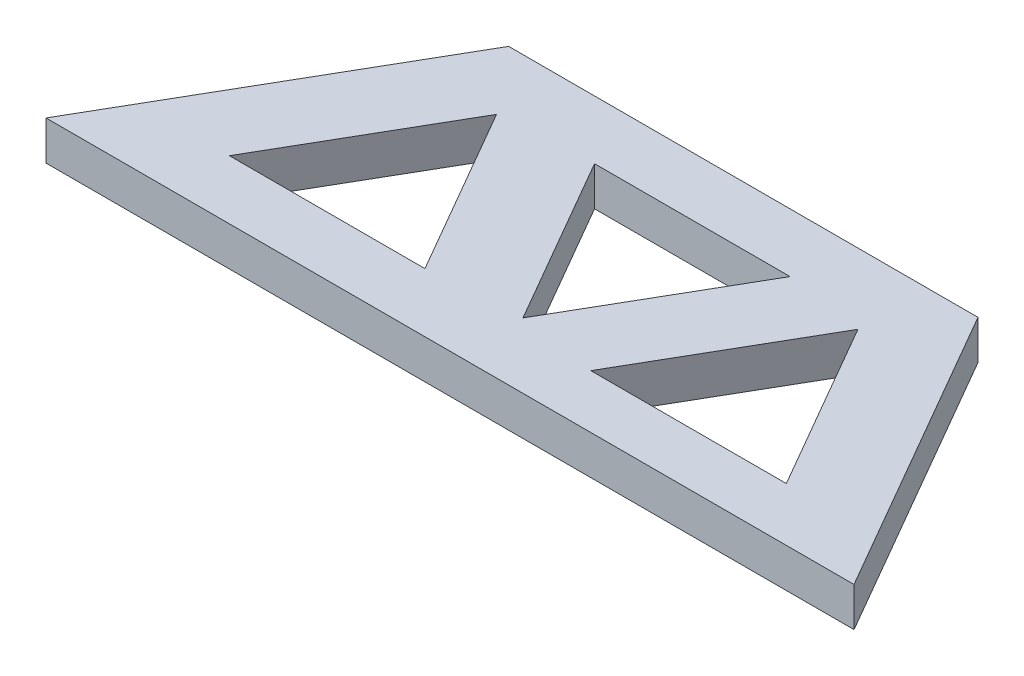
ISO-10303-21;
HEADER;
FILE_DESCRIPTION(('STEP AP214'),'2;1');
FILE_NAME('part.step','',(''),(''),'','','');
FILE_SCHEMA(('AUTOMOTIVE_DESIGN { 1 0 10303 214 1 1 1 1 }'));
ENDSEC;
DATA;
#1=APPLICATION_CONTEXT('core data for automotive mechanical design processes');
#2=APPLICATION_PROTOCOL_DEFINITION('international standard','automotive_design',2000,#1);
#3=PRODUCT_CONTEXT('',#1,'mechanical');
#4=PRODUCT('Part','Part','',(#3));
#5=PRODUCT_RELATED_PRODUCT_CATEGORY('part','',(#4));
#6=PRODUCT_DEFINITION_FORMATION('','',#4);
#7=PRODUCT_DEFINITION_CONTEXT('part definition',#1,'design');
#8=PRODUCT_DEFINITION('design','',#6,#7);
#9=PRODUCT_DEFINITION_SHAPE('','',#8);
#10=(LENGTH_UNIT() NAMED_UNIT(*) SI_UNIT(.MILLI.,.METRE.));
#11=(NAMED_UNIT(*) PLANE_ANGLE_UNIT() SI_UNIT($,.RADIAN.));
#12=(NAMED_UNIT(*) SI_UNIT($,.STERADIAN.) SOLID_ANGLE_UNIT());
#13=UNCERTAINTY_MEASURE_WITH_UNIT(LENGTH_MEASURE(1.E-05),#10,'distance_accuracy_value','');
#14=(GEOMETRIC_REPRESENTATION_CONTEXT(3) GLOBAL_UNCERTAINTY_ASSIGNED_CONTEXT((#13)) GLOBAL_UNIT_ASSIGNED_CONTEXT((#10,
#11,#12)) REPRESENTATION_CONTEXT('',''));
#15=CARTESIAN_POINT('',(0.,0.,0.));
#16=DIRECTION('',(0.,0.,1.));
#17=DIRECTION('',(1.,0.,0.));
#18=AXIS2_PLACEMENT_3D('',#15,#16,#17);
#19=CARTESIAN_POINT('',(0.,10.,0.));
#20=DIRECTION('',(0.,1.,0.));
#21=DIRECTION('',(0.,0.,1.));
#22=AXIS2_PLACEMENT_3D('',#19,#20,#21);
#23=PLANE('',#22);
#24=DIRECTION('',(-1.,0.,0.));
#25=VECTOR('',#24,1.);
#26=CARTESIAN_POINT('',(163.301270189222,10.,-75.));
#27=LINE('',#26,#25);
#28=CARTESIAN_POINT('',(163.301270189222,10.,-75.));
#29=VERTEX_POINT('',#28);
#30=CARTESIAN_POINT('',(43.3012701892224,10.,-75.));
#31=VERTEX_POINT('',#30);
#32=EDGE_CURVE('E202',#29,#31,#27,.T.);
#33=ORIENTED_EDGE('',*,*,#32,.T.);
#34=DIRECTION('',(-0.500000000000004,0.,0.866025403784436));
#35=VECTOR('',#34,1.);
#36=CARTESIAN_POINT('',(43.3012701892224,10.,-75.));
#37=LINE('',#36,#35);
#38=CARTESIAN_POINT('',(0.,10.,0.));
#39=VERTEX_POINT('',#38);
#40=EDGE_CURVE('E205',#31,#39,#37,.T.);
#41=ORIENTED_EDGE('',*,*,#40,.T.);
#42=DIRECTION('',(1.,0.,0.));
#43=VECTOR('',#42,1.);
#44=CARTESIAN_POINT('',(206.602540378444,10.,0.));
#45=LINE('',#44,#43);
#46=CARTESIAN_POINT('',(206.602540378444,10.,0.));
#47=VERTEX_POINT('',#46);
#48=EDGE_CURVE('E208',#39,#47,#45,.T.);
#49=ORIENTED_EDGE('',*,*,#48,.T.);
#50=DIRECTION('',(-0.499999999999998,0.,-0.86602540378444));
#51=VECTOR('',#50,1.);
#52=CARTESIAN_POINT('',(206.602540378444,10.,0.));
#53=LINE('',#52,#51);
#54=EDGE_CURVE('E210',#47,#29,#53,.T.);
#55=ORIENTED_EDGE('',*,*,#54,.T.);
#56=EDGE_LOOP('',(#33,#41,#49,#55));
#57=FACE_BOUND('',#56,.T.);
#58=DIRECTION('',(0.500000000000004,0.,-0.866025403784436));
#59=VECTOR('',#58,1.);
#60=CARTESIAN_POINT('',(130.254006688157,10.,-60.));
#61=LINE('',#60,#59);
#62=CARTESIAN_POINT('',(105.254006688156,10.,-16.698729810778));
#63=VERTEX_POINT('',#62);
#64=CARTESIAN_POINT('',(130.254006688157,10.,-60.));
#65=VERTEX_POINT('',#64);
#66=EDGE_CURVE('E180',#63,#65,#61,.T.);
#67=ORIENTED_EDGE('',*,*,#66,.F.);
#68=DIRECTION('',(0.499999999999998,0.,0.86602540378444));
#69=VECTOR('',#68,1.);
#70=CARTESIAN_POINT('',(80.2540066881565,10.,-60.));
#71=LINE('',#70,#69);
#72=CARTESIAN_POINT('',(80.2540066881565,10.,-60.));
#73=VERTEX_POINT('',#72);
#74=EDGE_CURVE('E178',#73,#63,#71,.T.);
#75=ORIENTED_EDGE('',*,*,#74,.F.);
#76=DIRECTION('',(-1.,0.,0.));
#77=VECTOR('',#76,1.);
#78=CARTESIAN_POINT('',(80.2540066881565,10.,-60.));
#79=LINE('',#78,#77);
#80=EDGE_CURVE('E184',#65,#73,#79,.T.);
#81=ORIENTED_EDGE('',*,*,#80,.F.);
#82=EDGE_LOOP('',(#67,#75,#81));
#83=FACE_BOUND('',#82,.T.);
#84=DIRECTION('',(-0.499999999999998,0.,-0.86602540378444));
#85=VECTOR('',#84,1.);
#86=CARTESIAN_POINT('',(150.601586083126,10.,-56.996498111834));
#87=LINE('',#86,#85);
#88=CARTESIAN_POINT('',(175.601586083126,10.,-13.6952279226118));
#89=VERTEX_POINT('',#88);
#90=CARTESIAN_POINT('',(150.601586083126,10.,-56.996498111834));
#91=VERTEX_POINT('',#90);
#92=EDGE_CURVE('E156',#89,#91,#87,.T.);
#93=ORIENTED_EDGE('',*,*,#92,.F.);
#94=DIRECTION('',(1.,0.,0.));
#95=VECTOR('',#94,1.);
#96=CARTESIAN_POINT('',(125.601586083126,10.,-13.6952279226118));
#97=LINE('',#96,#95);
#98=CARTESIAN_POINT('',(125.601586083126,10.,-13.6952279226118));
#99=VERTEX_POINT('',#98);
#100=EDGE_CURVE('E154',#99,#89,#97,.T.);
#101=ORIENTED_EDGE('',*,*,#100,.F.);
#102=DIRECTION('',(-0.499999999999998,0.,0.86602540378444));
#103=VECTOR('',#102,1.);
#104=CARTESIAN_POINT('',(125.601586083126,10.,-13.6952279226118));
#105=LINE('',#104,#103);
#106=EDGE_CURVE('E160',#91,#99,#105,.T.);
#107=ORIENTED_EDGE('',*,*,#106,.F.);
#108=EDGE_LOOP('',(#93,#101,#107));
#109=FACE_BOUND('',#108,.T.);
#110=DIRECTION('',(-0.499999999999993,0.,-0.866025403784443));
#111=VECTOR('',#110,1.);
#112=CARTESIAN_POINT('',(56.8043681212705,10.,-58.3880516778857));
#113=LINE('',#112,#111);
#114=CARTESIAN_POINT('',(81.8043681212702,10.,-15.0867814886635));
#115=VERTEX_POINT('',#114);
#116=CARTESIAN_POINT('',(56.8043681212706,10.,-58.3880516778857));
#117=VERTEX_POINT('',#116);
#118=EDGE_CURVE('E135',#115,#117,#113,.T.);
#119=ORIENTED_EDGE('',*,*,#118,.F.);
#120=DIRECTION('',(1.,0.,0.));
#121=VECTOR('',#120,1.);
#122=CARTESIAN_POINT('',(31.8043681212703,10.,-15.0867814886638));
#123=LINE('',#122,#121);
#124=CARTESIAN_POINT('',(31.8043681212703,10.,-15.0867814886638));
#125=VERTEX_POINT('',#124);
#126=EDGE_CURVE('E127',#125,#115,#123,.T.);
#127=ORIENTED_EDGE('',*,*,#126,.F.);
#128=DIRECTION('',(-0.500000000000004,0.,0.866025403784437));
#129=VECTOR('',#128,1.);
#130=CARTESIAN_POINT('',(31.8043681212703,10.,-15.0867814886638));
#131=LINE('',#130,#129);
#132=EDGE_CURVE('E144',#117,#125,#131,.T.);
#133=ORIENTED_EDGE('',*,*,#132,.F.);
#134=EDGE_LOOP('',(#119,#127,#133));
#135=FACE_BOUND('',#134,.T.);
#136=ADVANCED_FACE('F32',(#57,#83,#109,#135),#23,.T.);
#137=CARTESIAN_POINT('',(0.,0.,0.));
#138=DIRECTION('',(0.,1.,0.));
#139=DIRECTION('',(0.,0.,1.));
#140=AXIS2_PLACEMENT_3D('',#137,#138,#139);
#141=PLANE('',#140);
#142=DIRECTION('',(1.,0.,0.));
#143=VECTOR('',#142,1.);
#144=CARTESIAN_POINT('',(125.601586083126,0.,-13.6952279226118));
#145=LINE('',#144,#143);
#146=CARTESIAN_POINT('',(125.601586083126,0.,-13.6952279226118));
#147=VERTEX_POINT('',#146);
#148=CARTESIAN_POINT('',(175.601586083126,0.,-13.6952279226118));
#149=VERTEX_POINT('',#148);
#150=EDGE_CURVE('E142',#147,#149,#145,.T.);
#151=ORIENTED_EDGE('',*,*,#150,.T.);
#152=DIRECTION('',(-0.499999999999998,0.,-0.86602540378444));
#153=VECTOR('',#152,1.);
#154=CARTESIAN_POINT('',(150.601586083126,0.,-56.996498111834));
#155=LINE('',#154,#153);
#156=CARTESIAN_POINT('',(150.601586083126,0.,-56.996498111834));
#157=VERTEX_POINT('',#156);
#158=EDGE_CURVE('E165',#149,#157,#155,.T.);
#159=ORIENTED_EDGE('',*,*,#158,.T.);
#160=DIRECTION('',(-0.499999999999998,0.,0.86602540378444));
#161=VECTOR('',#160,1.);
#162=CARTESIAN_POINT('',(125.601586083126,0.,-13.6952279226118));
#163=LINE('',#162,#161);
#164=EDGE_CURVE('E157',#157,#147,#163,.T.);
#165=ORIENTED_EDGE('',*,*,#164,.T.);
#166=EDGE_LOOP('',(#151,#159,#165));
#167=FACE_BOUND('',#166,.T.);
#168=DIRECTION('',(-1.,0.,0.));
#169=VECTOR('',#168,1.);
#170=CARTESIAN_POINT('',(163.301270189222,0.,-75.));
#171=LINE('',#170,#169);
#172=CARTESIAN_POINT('',(163.301270189222,0.,-75.));
#173=VERTEX_POINT('',#172);
#174=CARTESIAN_POINT('',(43.3012701892224,0.,-75.));
#175=VERTEX_POINT('',#174);
#176=EDGE_CURVE('E201',#173,#175,#171,.T.);
#177=ORIENTED_EDGE('',*,*,#176,.F.);
#178=DIRECTION('',(-0.499999999999998,0.,-0.86602540378444));
#179=VECTOR('',#178,1.);
#180=CARTESIAN_POINT('',(206.602540378444,0.,0.));
#181=LINE('',#180,#179);
#182=CARTESIAN_POINT('',(206.602540378444,0.,0.));
#183=VERTEX_POINT('',#182);
#184=EDGE_CURVE('E206',#183,#173,#181,.T.);
#185=ORIENTED_EDGE('',*,*,#184,.F.);
#186=DIRECTION('',(1.,0.,0.));
#187=VECTOR('',#186,1.);
#188=CARTESIAN_POINT('',(206.602540378444,0.,0.));
#189=LINE('',#188,#187);
#190=CARTESIAN_POINT('',(0.,0.,0.));
#191=VERTEX_POINT('',#190);
#192=EDGE_CURVE('E217',#191,#183,#189,.T.);
#193=ORIENTED_EDGE('',*,*,#192,.F.);
#194=DIRECTION('',(-0.500000000000004,0.,0.866025403784436));
#195=VECTOR('',#194,1.);
#196=CARTESIAN_POINT('',(43.3012701892224,0.,-75.));
#197=LINE('',#196,#195);
#198=EDGE_CURVE('E215',#175,#191,#197,.T.);
#199=ORIENTED_EDGE('',*,*,#198,.F.);
#200=EDGE_LOOP('',(#177,#185,#193,#199));
#201=FACE_BOUND('',#200,.T.);
#202=DIRECTION('',(0.499999999999998,0.,0.86602540378444));
#203=VECTOR('',#202,1.);
#204=CARTESIAN_POINT('',(80.2540066881565,0.,-60.));
#205=LINE('',#204,#203);
#206=CARTESIAN_POINT('',(80.2540066881565,0.,-60.));
#207=VERTEX_POINT('',#206);
#208=CARTESIAN_POINT('',(105.254006688156,0.,-16.698729810778));
#209=VERTEX_POINT('',#208);
#210=EDGE_CURVE('E177',#207,#209,#205,.T.);
#211=ORIENTED_EDGE('',*,*,#210,.T.);
#212=DIRECTION('',(0.500000000000004,0.,-0.866025403784436));
#213=VECTOR('',#212,1.);
#214=CARTESIAN_POINT('',(130.254006688157,0.,-60.));
#215=LINE('',#214,#213);
#216=CARTESIAN_POINT('',(130.254006688157,0.,-60.));
#217=VERTEX_POINT('',#216);
#218=EDGE_CURVE('E189',#209,#217,#215,.T.);
#219=ORIENTED_EDGE('',*,*,#218,.T.);
#220=DIRECTION('',(-1.,0.,0.));
#221=VECTOR('',#220,1.);
#222=CARTESIAN_POINT('',(80.2540066881565,0.,-60.));
#223=LINE('',#222,#221);
#224=EDGE_CURVE('E181',#217,#207,#223,.T.);
#225=ORIENTED_EDGE('',*,*,#224,.T.);
#226=EDGE_LOOP('',(#211,#219,#225));
#227=FACE_BOUND('',#226,.T.);
#228=DIRECTION('',(1.,0.,0.));
#229=VECTOR('',#228,1.);
#230=CARTESIAN_POINT('',(31.8043681212703,0.,-15.0867814886638));
#231=LINE('',#230,#229);
#232=CARTESIAN_POINT('',(31.8043681212703,0.,-15.0867814886638));
#233=VERTEX_POINT('',#232);
#234=CARTESIAN_POINT('',(81.8043681212702,0.,-15.0867814886635));
#235=VERTEX_POINT('',#234);
#236=EDGE_CURVE('E55',#233,#235,#231,.T.);
#237=ORIENTED_EDGE('',*,*,#236,.T.);
#238=DIRECTION('',(-0.499999999999993,0.,-0.866025403784443));
#239=VECTOR('',#238,1.);
#240=CARTESIAN_POINT('',(56.8043681212705,0.,-58.3880516778857));
#241=LINE('',#240,#239);
#242=CARTESIAN_POINT('',(56.8043681212705,0.,-58.3880516778857));
#243=VERTEX_POINT('',#242);
#244=EDGE_CURVE('E141',#235,#243,#241,.T.);
#245=ORIENTED_EDGE('',*,*,#244,.T.);
#246=DIRECTION('',(-0.500000000000004,0.,0.866025403784437));
#247=VECTOR('',#246,1.);
#248=CARTESIAN_POINT('',(31.8043681212703,0.,-15.0867814886638));
#249=LINE('',#248,#247);
#250=EDGE_CURVE('E136',#243,#233,#249,.T.);
#251=ORIENTED_EDGE('',*,*,#250,.T.);
#252=EDGE_LOOP('',(#237,#245,#251));
#253=FACE_BOUND('',#252,.T.);
#254=ADVANCED_FACE('F235',(#167,#201,#227,#253),#141,.F.);
#255=CARTESIAN_POINT('',(163.301270189222,10.,-75.));
#256=DIRECTION('',(0.,0.,1.));
#257=DIRECTION('',(1.,0.,0.));
#258=AXIS2_PLACEMENT_3D('',#255,#256,#257);
#259=PLANE('',#258);
#260=ORIENTED_EDGE('',*,*,#176,.T.);
#261=DIRECTION('',(0.,-1.,0.));
#262=VECTOR('',#261,1.);
#263=CARTESIAN_POINT('',(43.3012701892224,10.,-75.));
#264=LINE('',#263,#262);
#265=EDGE_CURVE('E11',#31,#175,#264,.T.);
#266=ORIENTED_EDGE('',*,*,#265,.F.);
#267=ORIENTED_EDGE('',*,*,#32,.F.);
#268=DIRECTION('',(0.,-1.,0.));
#269=VECTOR('',#268,1.);
#270=CARTESIAN_POINT('',(163.301270189222,10.,-75.));
#271=LINE('',#270,#269);
#272=EDGE_CURVE('E212',#29,#173,#271,.T.);
#273=ORIENTED_EDGE('',*,*,#272,.T.);
#274=EDGE_LOOP('',(#260,#266,#267,#273));
#275=FACE_BOUND('',#274,.T.);
#276=ADVANCED_FACE('F34',(#275),#259,.F.);
#277=CARTESIAN_POINT('',(43.3012701892224,10.,-75.));
#278=DIRECTION('',(0.866025403784436,0.,0.500000000000004));
#279=DIRECTION('',(0.500000000000004,0.,-0.866025403784436));
#280=AXIS2_PLACEMENT_3D('',#277,#278,#279);
#281=PLANE('',#280);
#282=ORIENTED_EDGE('',*,*,#198,.T.);
#283=DIRECTION('',(0.,-1.,0.));
#284=VECTOR('',#283,1.);
#285=CARTESIAN_POINT('',(0.,10.,0.));
#286=LINE('',#285,#284);
#287=EDGE_CURVE('E40',#39,#191,#286,.T.);
#288=ORIENTED_EDGE('',*,*,#287,.F.);
#289=ORIENTED_EDGE('',*,*,#40,.F.);
#290=ORIENTED_EDGE('',*,*,#265,.T.);
#291=EDGE_LOOP('',(#282,#288,#289,#290));
#292=FACE_BOUND('',#291,.T.);
#293=ADVANCED_FACE('F246',(#292),#281,.F.);
#294=CARTESIAN_POINT('',(206.602540378444,10.,0.));
#295=DIRECTION('',(0.,0.,-1.));
#296=DIRECTION('',(-1.,0.,0.));
#297=AXIS2_PLACEMENT_3D('',#294,#295,#296);
#298=PLANE('',#297);
#299=ORIENTED_EDGE('',*,*,#192,.T.);
#300=DIRECTION('',(0.,-1.,0.));
#301=VECTOR('',#300,1.);
#302=CARTESIAN_POINT('',(206.602540378444,10.,0.));
#303=LINE('',#302,#301);
#304=EDGE_CURVE('E222',#47,#183,#303,.T.);
#305=ORIENTED_EDGE('',*,*,#304,.F.);
#306=ORIENTED_EDGE('',*,*,#48,.F.);
#307=ORIENTED_EDGE('',*,*,#287,.T.);
#308=EDGE_LOOP('',(#299,#305,#306,#307));
#309=FACE_BOUND('',#308,.T.);
#310=ADVANCED_FACE('F229',(#309),#298,.F.);
#311=CARTESIAN_POINT('',(206.602540378444,10.,0.));
#312=DIRECTION('',(-0.86602540378444,0.,0.499999999999998));
#313=DIRECTION('',(0.499999999999998,0.,0.86602540378444));
#314=AXIS2_PLACEMENT_3D('',#311,#312,#313);
#315=PLANE('',#314);
#316=ORIENTED_EDGE('',*,*,#184,.T.);
#317=ORIENTED_EDGE('',*,*,#272,.F.);
#318=ORIENTED_EDGE('',*,*,#54,.F.);
#319=ORIENTED_EDGE('',*,*,#304,.T.);
#320=EDGE_LOOP('',(#316,#317,#318,#319));
#321=FACE_BOUND('',#320,.T.);
#322=ADVANCED_FACE('F239',(#321),#315,.F.);
#323=CARTESIAN_POINT('',(80.2540066881565,10.,-60.));
#324=DIRECTION('',(0.86602540378444,0.,-0.499999999999998));
#325=DIRECTION('',(-0.499999999999998,0.,-0.86602540378444));
#326=AXIS2_PLACEMENT_3D('',#323,#324,#325);
#327=PLANE('',#326);
#328=ORIENTED_EDGE('',*,*,#210,.F.);
#329=DIRECTION('',(0.,-1.,0.));
#330=VECTOR('',#329,1.);
#331=CARTESIAN_POINT('',(80.2540066881565,10.,-60.));
#332=LINE('',#331,#330);
#333=EDGE_CURVE('E186',#73,#207,#332,.T.);
#334=ORIENTED_EDGE('',*,*,#333,.F.);
#335=ORIENTED_EDGE('',*,*,#74,.T.);
#336=DIRECTION('',(0.,-1.,0.));
#337=VECTOR('',#336,1.);
#338=CARTESIAN_POINT('',(105.254006688156,10.,-16.698729810778));
#339=LINE('',#338,#337);
#340=EDGE_CURVE('E198',#63,#209,#339,.T.);
#341=ORIENTED_EDGE('',*,*,#340,.T.);
#342=EDGE_LOOP('',(#328,#334,#335,#341));
#343=FACE_BOUND('',#342,.T.);
#344=ADVANCED_FACE('F261',(#343),#327,.T.);
#345=CARTESIAN_POINT('',(130.254006688157,10.,-60.));
#346=DIRECTION('',(-0.866025403784436,0.,-0.500000000000004));
#347=DIRECTION('',(-0.500000000000004,0.,0.866025403784436));
#348=AXIS2_PLACEMENT_3D('',#345,#346,#347);
#349=PLANE('',#348);
#350=ORIENTED_EDGE('',*,*,#218,.F.);
#351=ORIENTED_EDGE('',*,*,#340,.F.);
#352=ORIENTED_EDGE('',*,*,#66,.T.);
#353=DIRECTION('',(0.,-1.,0.));
#354=VECTOR('',#353,1.);
#355=CARTESIAN_POINT('',(130.254006688157,10.,-60.));
#356=LINE('',#355,#354);
#357=EDGE_CURVE('E196',#65,#217,#356,.T.);
#358=ORIENTED_EDGE('',*,*,#357,.T.);
#359=EDGE_LOOP('',(#350,#351,#352,#358));
#360=FACE_BOUND('',#359,.T.);
#361=ADVANCED_FACE('F268',(#360),#349,.T.);
#362=CARTESIAN_POINT('',(80.2540066881565,10.,-60.));
#363=DIRECTION('',(0.,0.,1.));
#364=DIRECTION('',(1.,0.,0.));
#365=AXIS2_PLACEMENT_3D('',#362,#363,#364);
#366=PLANE('',#365);
#367=ORIENTED_EDGE('',*,*,#224,.F.);
#368=ORIENTED_EDGE('',*,*,#357,.F.);
#369=ORIENTED_EDGE('',*,*,#80,.T.);
#370=ORIENTED_EDGE('',*,*,#333,.T.);
#371=EDGE_LOOP('',(#367,#368,#369,#370));
#372=FACE_BOUND('',#371,.T.);
#373=ADVANCED_FACE('F273',(#372),#366,.T.);
#374=CARTESIAN_POINT('',(125.601586083126,10.,-13.6952279226118));
#375=DIRECTION('',(0.,0.,-1.));
#376=DIRECTION('',(-1.,0.,0.));
#377=AXIS2_PLACEMENT_3D('',#374,#375,#376);
#378=PLANE('',#377);
#379=ORIENTED_EDGE('',*,*,#150,.F.);
#380=DIRECTION('',(0.,-1.,0.));
#381=VECTOR('',#380,1.);
#382=CARTESIAN_POINT('',(125.601586083126,10.,-13.6952279226118));
#383=LINE('',#382,#381);
#384=EDGE_CURVE('E162',#99,#147,#383,.T.);
#385=ORIENTED_EDGE('',*,*,#384,.F.);
#386=ORIENTED_EDGE('',*,*,#100,.T.);
#387=DIRECTION('',(0.,-1.,0.));
#388=VECTOR('',#387,1.);
#389=CARTESIAN_POINT('',(175.601586083126,10.,-13.6952279226118));
#390=LINE('',#389,#388);
#391=EDGE_CURVE('E174',#89,#149,#390,.T.);
#392=ORIENTED_EDGE('',*,*,#391,.T.);
#393=EDGE_LOOP('',(#379,#385,#386,#392));
#394=FACE_BOUND('',#393,.T.);
#395=ADVANCED_FACE('F292',(#394),#378,.T.);
#396=CARTESIAN_POINT('',(150.601586083126,10.,-56.996498111834));
#397=DIRECTION('',(-0.86602540378444,0.,0.499999999999998));
#398=DIRECTION('',(0.499999999999998,0.,0.86602540378444));
#399=AXIS2_PLACEMENT_3D('',#396,#397,#398);
#400=PLANE('',#399);
#401=ORIENTED_EDGE('',*,*,#158,.F.);
#402=ORIENTED_EDGE('',*,*,#391,.F.);
#403=ORIENTED_EDGE('',*,*,#92,.T.);
#404=DIRECTION('',(0.,-1.,0.));
#405=VECTOR('',#404,1.);
#406=CARTESIAN_POINT('',(150.601586083126,10.,-56.996498111834));
#407=LINE('',#406,#405);
#408=EDGE_CURVE('E172',#91,#157,#407,.T.);
#409=ORIENTED_EDGE('',*,*,#408,.T.);
#410=EDGE_LOOP('',(#401,#402,#403,#409));
#411=FACE_BOUND('',#410,.T.);
#412=ADVANCED_FACE('F289',(#411),#400,.T.);
#413=CARTESIAN_POINT('',(125.601586083126,10.,-13.6952279226118));
#414=DIRECTION('',(0.86602540378444,0.,0.499999999999998));
#415=DIRECTION('',(0.499999999999998,0.,-0.86602540378444));
#416=AXIS2_PLACEMENT_3D('',#413,#414,#415);
#417=PLANE('',#416);
#418=ORIENTED_EDGE('',*,*,#164,.F.);
#419=ORIENTED_EDGE('',*,*,#408,.F.);
#420=ORIENTED_EDGE('',*,*,#106,.T.);
#421=ORIENTED_EDGE('',*,*,#384,.T.);
#422=EDGE_LOOP('',(#418,#419,#420,#421));
#423=FACE_BOUND('',#422,.T.);
#424=ADVANCED_FACE('F295',(#423),#417,.T.);
#425=CARTESIAN_POINT('',(31.8043681212703,10.,-15.0867814886638));
#426=DIRECTION('',(0.,0.,-1.));
#427=DIRECTION('',(-1.,0.,0.));
#428=AXIS2_PLACEMENT_3D('',#425,#426,#427);
#429=PLANE('',#428);
#430=ORIENTED_EDGE('',*,*,#236,.F.);
#431=DIRECTION('',(0.,-1.,0.));
#432=VECTOR('',#431,1.);
#433=CARTESIAN_POINT('',(31.8043681212703,10.,-15.0867814886638));
#434=LINE('',#433,#432);
#435=EDGE_CURVE('E131',#125,#233,#434,.T.);
#436=ORIENTED_EDGE('',*,*,#435,.F.);
#437=ORIENTED_EDGE('',*,*,#126,.T.);
#438=DIRECTION('',(0.,-1.,0.));
#439=VECTOR('',#438,1.);
#440=CARTESIAN_POINT('',(81.8043681212702,10.,-15.0867814886635));
#441=LINE('',#440,#439);
#442=EDGE_CURVE('E130',#115,#235,#441,.T.);
#443=ORIENTED_EDGE('',*,*,#442,.T.);
#444=EDGE_LOOP('',(#430,#436,#437,#443));
#445=FACE_BOUND('',#444,.T.);
#446=ADVANCED_FACE('F129',(#445),#429,.T.);
#447=CARTESIAN_POINT('',(56.8043681212705,10.,-58.3880516778857));
#448=DIRECTION('',(-0.866025403784442,0.,0.499999999999993));
#449=DIRECTION('',(0.499999999999993,0.,0.866025403784442));
#450=AXIS2_PLACEMENT_3D('',#447,#448,#449);
#451=PLANE('',#450);
#452=ORIENTED_EDGE('',*,*,#244,.F.);
#453=ORIENTED_EDGE('',*,*,#442,.F.);
#454=ORIENTED_EDGE('',*,*,#118,.T.);
#455=DIRECTION('',(0.,-1.,0.));
#456=VECTOR('',#455,1.);
#457=CARTESIAN_POINT('',(56.8043681212705,10.,-58.3880516778857));
#458=LINE('',#457,#456);
#459=EDGE_CURVE('E47',#117,#243,#458,.T.);
#460=ORIENTED_EDGE('',*,*,#459,.T.);
#461=EDGE_LOOP('',(#452,#453,#454,#460));
#462=FACE_BOUND('',#461,.T.);
#463=ADVANCED_FACE('F139',(#462),#451,.T.);
#464=CARTESIAN_POINT('',(31.8043681212703,10.,-15.0867814886638));
#465=DIRECTION('',(0.866025403784436,0.,0.500000000000004));
#466=DIRECTION('',(0.500000000000004,0.,-0.866025403784436));
#467=AXIS2_PLACEMENT_3D('',#464,#465,#466);
#468=PLANE('',#467);
#469=ORIENTED_EDGE('',*,*,#250,.F.);
#470=ORIENTED_EDGE('',*,*,#459,.F.);
#471=ORIENTED_EDGE('',*,*,#132,.T.);
#472=ORIENTED_EDGE('',*,*,#435,.T.);
#473=EDGE_LOOP('',(#469,#470,#471,#472));
#474=FACE_BOUND('',#473,.T.);
#475=ADVANCED_FACE('F340',(#474),#468,.T.);
#476=CLOSED_SHELL('',(#136,#254,#276,#293,#310,#322,#344,#361,#373,#395,#412,#424,#446,#463,#475));
#477=MANIFOLD_SOLID_BREP('B2',#476);
#478=ADVANCED_BREP_SHAPE_REPRESENTATION('',(#18,#477),#14);
#479=SHAPE_DEFINITION_REPRESENTATION(#9,#478);
ENDSEC;
END-ISO-10303-21;
